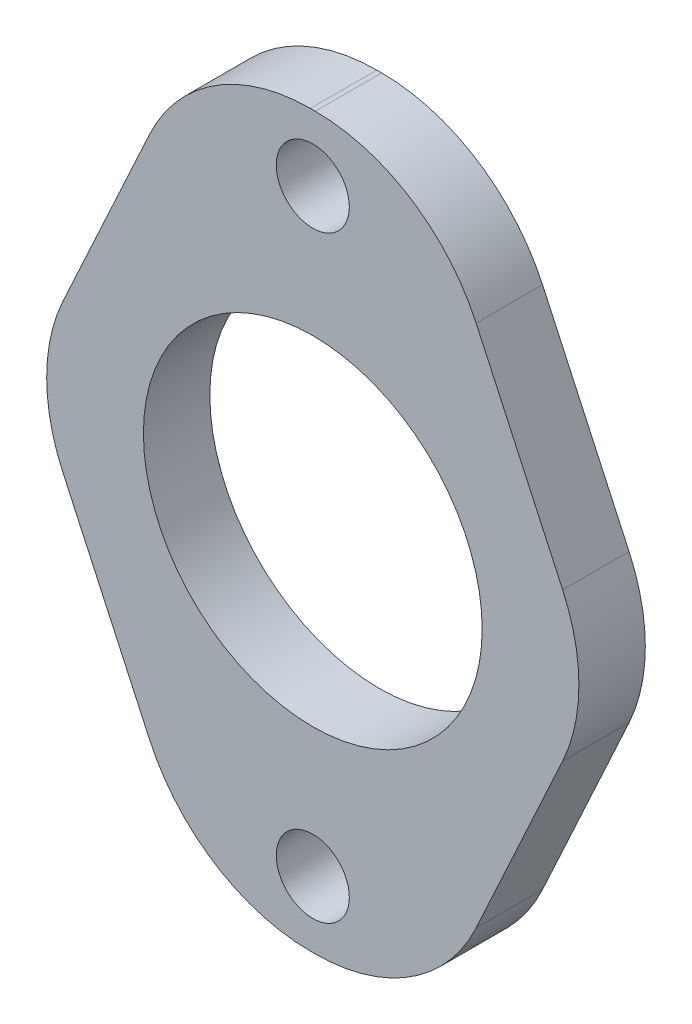
ISO-10303-21;
HEADER;
FILE_DESCRIPTION(('STEP AP214'),'2;1');
FILE_NAME('part.step','',(''),(''),'','','');
FILE_SCHEMA(('AUTOMOTIVE_DESIGN { 1 0 10303 214 1 1 1 1 }'));
ENDSEC;
DATA;
#1=APPLICATION_CONTEXT('core data for automotive mechanical design processes');
#2=APPLICATION_PROTOCOL_DEFINITION('international standard','automotive_design',2000,#1);
#3=PRODUCT_CONTEXT('',#1,'mechanical');
#4=PRODUCT('Part','Part','',(#3));
#5=PRODUCT_RELATED_PRODUCT_CATEGORY('part','',(#4));
#6=PRODUCT_DEFINITION_FORMATION('','',#4);
#7=PRODUCT_DEFINITION_CONTEXT('part definition',#1,'design');
#8=PRODUCT_DEFINITION('design','',#6,#7);
#9=PRODUCT_DEFINITION_SHAPE('','',#8);
#10=(LENGTH_UNIT() NAMED_UNIT(*) SI_UNIT(.MILLI.,.METRE.));
#11=(NAMED_UNIT(*) PLANE_ANGLE_UNIT() SI_UNIT($,.RADIAN.));
#12=(NAMED_UNIT(*) SI_UNIT($,.STERADIAN.) SOLID_ANGLE_UNIT());
#13=UNCERTAINTY_MEASURE_WITH_UNIT(LENGTH_MEASURE(1.E-05),#10,'distance_accuracy_value','');
#14=(GEOMETRIC_REPRESENTATION_CONTEXT(3) GLOBAL_UNCERTAINTY_ASSIGNED_CONTEXT((#13)) GLOBAL_UNIT_ASSIGNED_CONTEXT((#10,
#11,#12)) REPRESENTATION_CONTEXT('',''));
#15=CARTESIAN_POINT('',(0.,0.,0.));
#16=DIRECTION('',(0.,0.,1.));
#17=DIRECTION('',(1.,0.,0.));
#18=AXIS2_PLACEMENT_3D('',#15,#16,#17);
#19=CARTESIAN_POINT('',(0.,0.,3.));
#20=DIRECTION('',(0.,0.,1.));
#21=DIRECTION('',(1.,0.,0.));
#22=AXIS2_PLACEMENT_3D('',#19,#20,#21);
#23=PLANE('',#22);
#24=CARTESIAN_POINT('',(0.,-13.5,3.));
#25=DIRECTION('',(0.,0.,1.));
#26=DIRECTION('',(1.,0.,0.));
#27=AXIS2_PLACEMENT_3D('',#24,#25,#26);
#28=CIRCLE('',#27,1.65);
#29=CARTESIAN_POINT('',(1.65,-13.5,3.));
#30=VERTEX_POINT('',#29);
#31=EDGE_CURVE('E375',#30,#30,#28,.T.);
#32=ORIENTED_EDGE('',*,*,#31,.F.);
#33=EDGE_LOOP('',(#32));
#34=FACE_BOUND('',#33,.T.);
#35=DIRECTION('',(0.418518518518519,0.908208263371934,0.));
#36=VECTOR('',#35,1.);
#37=CARTESIAN_POINT('',(12.8274543073927,0.,3.));
#38=LINE('',#37,#36);
#39=CARTESIAN_POINT('',(7.37683329960607,-11.8281481481482,3.));
#40=VERTEX_POINT('',#39);
#41=CARTESIAN_POINT('',(11.2845681002788,-3.34814814814815,3.));
#42=VERTEX_POINT('',#41);
#43=EDGE_CURVE('E167',#40,#42,#38,.T.);
#44=ORIENTED_EDGE('',*,*,#43,.T.);
#45=CARTESIAN_POINT('',(4.01890199330331,0.,3.));
#46=DIRECTION('',(0.,0.,1.));
#47=DIRECTION('',(1.,0.,0.));
#48=AXIS2_PLACEMENT_3D('',#45,#46,#47);
#49=CIRCLE('',#48,8.);
#50=CARTESIAN_POINT('',(11.2845681002788,3.34814814814815,3.));
#51=VERTEX_POINT('',#50);
#52=EDGE_CURVE('E190',#42,#51,#49,.T.);
#53=ORIENTED_EDGE('',*,*,#52,.T.);
#54=DIRECTION('',(-0.418518518518519,0.908208263371934,0.));
#55=VECTOR('',#54,1.);
#56=CARTESIAN_POINT('',(12.8274543073927,0.,3.));
#57=LINE('',#56,#55);
#58=CARTESIAN_POINT('',(7.37683329960606,11.8281481481482,3.));
#59=VERTEX_POINT('',#58);
#60=EDGE_CURVE('E143',#51,#59,#57,.T.);
#61=ORIENTED_EDGE('',*,*,#60,.T.);
#62=CARTESIAN_POINT('',(0.111167192630593,8.48,3.));
#63=DIRECTION('',(0.,0.,1.));
#64=DIRECTION('',(1.,0.,0.));
#65=AXIS2_PLACEMENT_3D('',#62,#63,#64);
#66=CIRCLE('',#65,8.);
#67=CARTESIAN_POINT('',(0.111167192630593,16.48,3.));
#68=VERTEX_POINT('',#67);
#69=EDGE_CURVE('E181',#59,#68,#66,.T.);
#70=ORIENTED_EDGE('',*,*,#69,.T.);
#71=DIRECTION('',(-1.,0.,0.));
#72=VECTOR('',#71,1.);
#73=CARTESIAN_POINT('',(-5.23317724193445,16.48,3.));
#74=LINE('',#73,#72);
#75=CARTESIAN_POINT('',(-0.111167192630594,16.48,3.));
#76=VERTEX_POINT('',#75);
#77=EDGE_CURVE('E212',#68,#76,#74,.T.);
#78=ORIENTED_EDGE('',*,*,#77,.T.);
#79=CARTESIAN_POINT('',(-0.111167192630594,8.48,3.));
#80=DIRECTION('',(0.,0.,1.));
#81=DIRECTION('',(1.,0.,0.));
#82=AXIS2_PLACEMENT_3D('',#79,#80,#81);
#83=CIRCLE('',#82,8.);
#84=CARTESIAN_POINT('',(-7.37683329960607,11.8281481481482,3.));
#85=VERTEX_POINT('',#84);
#86=EDGE_CURVE('E183',#76,#85,#83,.T.);
#87=ORIENTED_EDGE('',*,*,#86,.T.);
#88=DIRECTION('',(-0.418518518518519,-0.908208263371934,0.));
#89=VECTOR('',#88,1.);
#90=CARTESIAN_POINT('',(-12.8274543073927,0.,3.));
#91=LINE('',#90,#89);
#92=CARTESIAN_POINT('',(-11.2845681002788,3.34814814814815,3.));
#93=VERTEX_POINT('',#92);
#94=EDGE_CURVE('E225',#85,#93,#91,.T.);
#95=ORIENTED_EDGE('',*,*,#94,.T.);
#96=CARTESIAN_POINT('',(-4.01890199330331,0.,3.));
#97=DIRECTION('',(0.,0.,1.));
#98=DIRECTION('',(1.,0.,0.));
#99=AXIS2_PLACEMENT_3D('',#96,#97,#98);
#100=CIRCLE('',#99,8.);
#101=CARTESIAN_POINT('',(-11.2845681002788,-3.34814814814815,3.));
#102=VERTEX_POINT('',#101);
#103=EDGE_CURVE('E188',#93,#102,#100,.T.);
#104=ORIENTED_EDGE('',*,*,#103,.T.);
#105=DIRECTION('',(0.418518518518519,-0.908208263371934,0.));
#106=VECTOR('',#105,1.);
#107=CARTESIAN_POINT('',(-12.8274543073927,0.,3.));
#108=LINE('',#107,#106);
#109=CARTESIAN_POINT('',(-7.37683329960607,-11.8281481481482,3.));
#110=VERTEX_POINT('',#109);
#111=EDGE_CURVE('E227',#102,#110,#108,.T.);
#112=ORIENTED_EDGE('',*,*,#111,.T.);
#113=CARTESIAN_POINT('',(-0.111167192630594,-8.48,3.));
#114=DIRECTION('',(0.,0.,1.));
#115=DIRECTION('',(1.,0.,0.));
#116=AXIS2_PLACEMENT_3D('',#113,#114,#115);
#117=CIRCLE('',#116,8.);
#118=CARTESIAN_POINT('',(-0.111167192630594,-16.48,3.));
#119=VERTEX_POINT('',#118);
#120=EDGE_CURVE('E55',#110,#119,#117,.T.);
#121=ORIENTED_EDGE('',*,*,#120,.T.);
#122=DIRECTION('',(1.,0.,0.));
#123=VECTOR('',#122,1.);
#124=CARTESIAN_POINT('',(-5.23317724193445,-16.48,3.));
#125=LINE('',#124,#123);
#126=CARTESIAN_POINT('',(0.111167192630594,-16.48,3.));
#127=VERTEX_POINT('',#126);
#128=EDGE_CURVE('E168',#119,#127,#125,.T.);
#129=ORIENTED_EDGE('',*,*,#128,.T.);
#130=CARTESIAN_POINT('',(0.111167192630594,-8.48,3.));
#131=DIRECTION('',(0.,0.,1.));
#132=DIRECTION('',(1.,0.,0.));
#133=AXIS2_PLACEMENT_3D('',#130,#131,#132);
#134=CIRCLE('',#133,8.);
#135=EDGE_CURVE('E186',#127,#40,#134,.T.);
#136=ORIENTED_EDGE('',*,*,#135,.T.);
#137=EDGE_LOOP('',(#44,#53,#61,#70,#78,#87,#95,#104,#112,#121,#129,#136));
#138=FACE_BOUND('',#137,.T.);
#139=CARTESIAN_POINT('',(0.,0.,3.));
#140=DIRECTION('',(0.,0.,1.));
#141=DIRECTION('',(1.,0.,0.));
#142=AXIS2_PLACEMENT_3D('',#139,#140,#141);
#143=CIRCLE('',#142,7.65);
#144=CARTESIAN_POINT('',(7.65,0.,3.));
#145=VERTEX_POINT('',#144);
#146=EDGE_CURVE('E156',#145,#145,#143,.T.);
#147=ORIENTED_EDGE('',*,*,#146,.F.);
#148=EDGE_LOOP('',(#147));
#149=FACE_BOUND('',#148,.T.);
#150=CARTESIAN_POINT('',(0.,13.5,3.));
#151=DIRECTION('',(0.,0.,1.));
#152=DIRECTION('',(1.,0.,0.));
#153=AXIS2_PLACEMENT_3D('',#150,#151,#152);
#154=CIRCLE('',#153,1.65);
#155=CARTESIAN_POINT('',(1.65,13.5,3.));
#156=VERTEX_POINT('',#155);
#157=EDGE_CURVE('E381',#156,#156,#154,.T.);
#158=ORIENTED_EDGE('',*,*,#157,.F.);
#159=EDGE_LOOP('',(#158));
#160=FACE_BOUND('',#159,.T.);
#161=ADVANCED_FACE('F33',(#34,#138,#149,#160),#23,.T.);
#162=CARTESIAN_POINT('',(0.,0.,0.));
#163=DIRECTION('',(0.,0.,1.));
#164=DIRECTION('',(1.,0.,0.));
#165=AXIS2_PLACEMENT_3D('',#162,#163,#164);
#166=PLANE('',#165);
#167=DIRECTION('',(-0.418518518518519,0.908208263371934,0.));
#168=VECTOR('',#167,1.);
#169=CARTESIAN_POINT('',(12.8274543073927,0.,0.));
#170=LINE('',#169,#168);
#171=CARTESIAN_POINT('',(11.2845681002788,3.34814814814815,0.));
#172=VERTEX_POINT('',#171);
#173=CARTESIAN_POINT('',(7.37683329960606,11.8281481481482,0.));
#174=VERTEX_POINT('',#173);
#175=EDGE_CURVE('E140',#172,#174,#170,.T.);
#176=ORIENTED_EDGE('',*,*,#175,.F.);
#177=CARTESIAN_POINT('',(4.01890199330331,0.,0.));
#178=DIRECTION('',(0.,0.,1.));
#179=DIRECTION('',(1.,0.,0.));
#180=AXIS2_PLACEMENT_3D('',#177,#178,#179);
#181=CIRCLE('',#180,8.);
#182=CARTESIAN_POINT('',(11.2845681002788,-3.34814814814815,0.));
#183=VERTEX_POINT('',#182);
#184=EDGE_CURVE('E123',#172,#183,#181,.F.);
#185=ORIENTED_EDGE('',*,*,#184,.T.);
#186=DIRECTION('',(0.418518518518519,0.908208263371934,0.));
#187=VECTOR('',#186,1.);
#188=CARTESIAN_POINT('',(12.8274543073927,0.,0.));
#189=LINE('',#188,#187);
#190=CARTESIAN_POINT('',(7.37683329960607,-11.8281481481482,0.));
#191=VERTEX_POINT('',#190);
#192=EDGE_CURVE('E151',#191,#183,#189,.T.);
#193=ORIENTED_EDGE('',*,*,#192,.F.);
#194=CARTESIAN_POINT('',(0.111167192630594,-8.48,0.));
#195=DIRECTION('',(0.,0.,1.));
#196=DIRECTION('',(1.,0.,0.));
#197=AXIS2_PLACEMENT_3D('',#194,#195,#196);
#198=CIRCLE('',#197,8.);
#199=CARTESIAN_POINT('',(0.111167192630594,-16.48,0.));
#200=VERTEX_POINT('',#199);
#201=EDGE_CURVE('E175',#191,#200,#198,.F.);
#202=ORIENTED_EDGE('',*,*,#201,.T.);
#203=DIRECTION('',(1.,0.,0.));
#204=VECTOR('',#203,1.);
#205=CARTESIAN_POINT('',(-5.23317724193445,-16.48,0.));
#206=LINE('',#205,#204);
#207=CARTESIAN_POINT('',(-0.111167192630594,-16.48,0.));
#208=VERTEX_POINT('',#207);
#209=EDGE_CURVE('E165',#208,#200,#206,.T.);
#210=ORIENTED_EDGE('',*,*,#209,.F.);
#211=CARTESIAN_POINT('',(-0.111167192630594,-8.48,0.));
#212=DIRECTION('',(0.,0.,1.));
#213=DIRECTION('',(1.,0.,0.));
#214=AXIS2_PLACEMENT_3D('',#211,#212,#213);
#215=CIRCLE('',#214,8.);
#216=CARTESIAN_POINT('',(-7.37683329960607,-11.8281481481482,0.));
#217=VERTEX_POINT('',#216);
#218=EDGE_CURVE('E173',#208,#217,#215,.F.);
#219=ORIENTED_EDGE('',*,*,#218,.T.);
#220=DIRECTION('',(0.418518518518519,-0.908208263371934,0.));
#221=VECTOR('',#220,1.);
#222=CARTESIAN_POINT('',(-12.8274543073927,0.,0.));
#223=LINE('',#222,#221);
#224=CARTESIAN_POINT('',(-11.2845681002788,-3.34814814814815,0.));
#225=VERTEX_POINT('',#224);
#226=EDGE_CURVE('E162',#225,#217,#223,.T.);
#227=ORIENTED_EDGE('',*,*,#226,.F.);
#228=CARTESIAN_POINT('',(-4.01890199330331,0.,0.));
#229=DIRECTION('',(0.,0.,1.));
#230=DIRECTION('',(1.,0.,0.));
#231=AXIS2_PLACEMENT_3D('',#228,#229,#230);
#232=CIRCLE('',#231,8.);
#233=CARTESIAN_POINT('',(-11.2845681002788,3.34814814814815,0.));
#234=VERTEX_POINT('',#233);
#235=EDGE_CURVE('E134',#225,#234,#232,.F.);
#236=ORIENTED_EDGE('',*,*,#235,.T.);
#237=DIRECTION('',(-0.418518518518519,-0.908208263371934,0.));
#238=VECTOR('',#237,1.);
#239=CARTESIAN_POINT('',(-12.8274543073927,0.,0.));
#240=LINE('',#239,#238);
#241=CARTESIAN_POINT('',(-7.37683329960607,11.8281481481482,0.));
#242=VERTEX_POINT('',#241);
#243=EDGE_CURVE('E154',#242,#234,#240,.T.);
#244=ORIENTED_EDGE('',*,*,#243,.F.);
#245=CARTESIAN_POINT('',(-0.111167192630594,8.48,0.));
#246=DIRECTION('',(0.,0.,1.));
#247=DIRECTION('',(1.,0.,0.));
#248=AXIS2_PLACEMENT_3D('',#245,#246,#247);
#249=CIRCLE('',#248,8.);
#250=CARTESIAN_POINT('',(-0.111167192630594,16.48,0.));
#251=VERTEX_POINT('',#250);
#252=EDGE_CURVE('E171',#242,#251,#249,.F.);
#253=ORIENTED_EDGE('',*,*,#252,.T.);
#254=DIRECTION('',(-1.,0.,0.));
#255=VECTOR('',#254,1.);
#256=CARTESIAN_POINT('',(-5.23317724193445,16.48,0.));
#257=LINE('',#256,#255);
#258=CARTESIAN_POINT('',(0.111167192630593,16.48,0.));
#259=VERTEX_POINT('',#258);
#260=EDGE_CURVE('E150',#259,#251,#257,.T.);
#261=ORIENTED_EDGE('',*,*,#260,.F.);
#262=CARTESIAN_POINT('',(0.111167192630593,8.48,0.));
#263=DIRECTION('',(0.,0.,1.));
#264=DIRECTION('',(1.,0.,0.));
#265=AXIS2_PLACEMENT_3D('',#262,#263,#264);
#266=CIRCLE('',#265,8.);
#267=EDGE_CURVE('E144',#259,#174,#266,.F.);
#268=ORIENTED_EDGE('',*,*,#267,.T.);
#269=EDGE_LOOP('',(#176,#185,#193,#202,#210,#219,#227,#236,#244,#253,#261,#268));
#270=FACE_BOUND('',#269,.T.);
#271=CARTESIAN_POINT('',(0.,0.,0.));
#272=DIRECTION('',(0.,0.,1.));
#273=DIRECTION('',(1.,0.,0.));
#274=AXIS2_PLACEMENT_3D('',#271,#272,#273);
#275=CIRCLE('',#274,7.65);
#276=CARTESIAN_POINT('',(7.65,0.,0.));
#277=VERTEX_POINT('',#276);
#278=EDGE_CURVE('E372',#277,#277,#275,.T.);
#279=ORIENTED_EDGE('',*,*,#278,.T.);
#280=EDGE_LOOP('',(#279));
#281=FACE_BOUND('',#280,.T.);
#282=CARTESIAN_POINT('',(0.,-13.5,0.));
#283=DIRECTION('',(0.,0.,1.));
#284=DIRECTION('',(1.,0.,0.));
#285=AXIS2_PLACEMENT_3D('',#282,#283,#284);
#286=CIRCLE('',#285,1.65);
#287=CARTESIAN_POINT('',(1.65,-13.5,0.));
#288=VERTEX_POINT('',#287);
#289=EDGE_CURVE('E378',#288,#288,#286,.T.);
#290=ORIENTED_EDGE('',*,*,#289,.T.);
#291=EDGE_LOOP('',(#290));
#292=FACE_BOUND('',#291,.T.);
#293=CARTESIAN_POINT('',(0.,13.5,0.));
#294=DIRECTION('',(0.,0.,1.));
#295=DIRECTION('',(1.,0.,0.));
#296=AXIS2_PLACEMENT_3D('',#293,#294,#295);
#297=CIRCLE('',#296,1.65);
#298=CARTESIAN_POINT('',(1.65,13.5,0.));
#299=VERTEX_POINT('',#298);
#300=EDGE_CURVE('E384',#299,#299,#297,.T.);
#301=ORIENTED_EDGE('',*,*,#300,.T.);
#302=EDGE_LOOP('',(#301));
#303=FACE_BOUND('',#302,.T.);
#304=ADVANCED_FACE('F147',(#270,#281,#292,#303),#166,.F.);
#305=CARTESIAN_POINT('',(12.8274543073927,0.,3.));
#306=DIRECTION('',(-0.908208263371934,0.418518518518519,0.));
#307=DIRECTION('',(-0.418518518518519,-0.908208263371934,0.));
#308=AXIS2_PLACEMENT_3D('',#305,#306,#307);
#309=PLANE('',#308);
#310=ORIENTED_EDGE('',*,*,#192,.T.);
#311=DIRECTION('',(0.,0.,-1.));
#312=VECTOR('',#311,1.);
#313=CARTESIAN_POINT('',(11.2845681002788,-3.34814814814815,3.));
#314=LINE('',#313,#312);
#315=EDGE_CURVE('E128',#183,#42,#314,.F.);
#316=ORIENTED_EDGE('',*,*,#315,.T.);
#317=ORIENTED_EDGE('',*,*,#43,.F.);
#318=DIRECTION('',(0.,0.,-1.));
#319=VECTOR('',#318,1.);
#320=CARTESIAN_POINT('',(7.37683329960607,-11.8281481481482,3.));
#321=LINE('',#320,#319);
#322=EDGE_CURVE('E133',#40,#191,#321,.T.);
#323=ORIENTED_EDGE('',*,*,#322,.T.);
#324=EDGE_LOOP('',(#310,#316,#317,#323));
#325=FACE_BOUND('',#324,.T.);
#326=ADVANCED_FACE('F241',(#325),#309,.F.);
#327=CARTESIAN_POINT('',(12.8274543073927,0.,3.));
#328=DIRECTION('',(-0.908208263371934,-0.418518518518519,0.));
#329=DIRECTION('',(0.418518518518519,-0.908208263371934,0.));
#330=AXIS2_PLACEMENT_3D('',#327,#328,#329);
#331=PLANE('',#330);
#332=ORIENTED_EDGE('',*,*,#60,.F.);
#333=DIRECTION('',(0.,0.,-1.));
#334=VECTOR('',#333,1.);
#335=CARTESIAN_POINT('',(11.2845681002788,3.34814814814815,3.));
#336=LINE('',#335,#334);
#337=EDGE_CURVE('E127',#51,#172,#336,.T.);
#338=ORIENTED_EDGE('',*,*,#337,.T.);
#339=ORIENTED_EDGE('',*,*,#175,.T.);
#340=DIRECTION('',(0.,0.,-1.));
#341=VECTOR('',#340,1.);
#342=CARTESIAN_POINT('',(7.37683329960606,11.8281481481482,3.));
#343=LINE('',#342,#341);
#344=EDGE_CURVE('E145',#174,#59,#343,.F.);
#345=ORIENTED_EDGE('',*,*,#344,.T.);
#346=EDGE_LOOP('',(#332,#338,#339,#345));
#347=FACE_BOUND('',#346,.T.);
#348=ADVANCED_FACE('F139',(#347),#331,.F.);
#349=CARTESIAN_POINT('',(-5.23317724193445,16.48,3.));
#350=DIRECTION('',(0.,-1.,0.));
#351=DIRECTION('',(0.,0.,-1.));
#352=AXIS2_PLACEMENT_3D('',#349,#350,#351);
#353=PLANE('',#352);
#354=ORIENTED_EDGE('',*,*,#260,.T.);
#355=DIRECTION('',(0.,0.,-1.));
#356=VECTOR('',#355,1.);
#357=CARTESIAN_POINT('',(-0.111167192630594,16.48,3.));
#358=LINE('',#357,#356);
#359=EDGE_CURVE('E11',#251,#76,#358,.F.);
#360=ORIENTED_EDGE('',*,*,#359,.T.);
#361=ORIENTED_EDGE('',*,*,#77,.F.);
#362=DIRECTION('',(0.,0.,-1.));
#363=VECTOR('',#362,1.);
#364=CARTESIAN_POINT('',(0.111167192630593,16.48,3.));
#365=LINE('',#364,#363);
#366=EDGE_CURVE('E41',#68,#259,#365,.T.);
#367=ORIENTED_EDGE('',*,*,#366,.T.);
#368=EDGE_LOOP('',(#354,#360,#361,#367));
#369=FACE_BOUND('',#368,.T.);
#370=ADVANCED_FACE('F209',(#369),#353,.F.);
#371=CARTESIAN_POINT('',(-12.8274543073927,0.,3.));
#372=DIRECTION('',(0.908208263371934,-0.418518518518519,0.));
#373=DIRECTION('',(0.418518518518519,0.908208263371934,0.));
#374=AXIS2_PLACEMENT_3D('',#371,#372,#373);
#375=PLANE('',#374);
#376=ORIENTED_EDGE('',*,*,#243,.T.);
#377=DIRECTION('',(0.,0.,-1.));
#378=VECTOR('',#377,1.);
#379=CARTESIAN_POINT('',(-11.2845681002788,3.34814814814815,3.));
#380=LINE('',#379,#378);
#381=EDGE_CURVE('E200',#234,#93,#380,.F.);
#382=ORIENTED_EDGE('',*,*,#381,.T.);
#383=ORIENTED_EDGE('',*,*,#94,.F.);
#384=DIRECTION('',(0.,0.,-1.));
#385=VECTOR('',#384,1.);
#386=CARTESIAN_POINT('',(-7.37683329960607,11.8281481481482,3.));
#387=LINE('',#386,#385);
#388=EDGE_CURVE('E197',#85,#242,#387,.T.);
#389=ORIENTED_EDGE('',*,*,#388,.T.);
#390=EDGE_LOOP('',(#376,#382,#383,#389));
#391=FACE_BOUND('',#390,.T.);
#392=ADVANCED_FACE('F222',(#391),#375,.F.);
#393=CARTESIAN_POINT('',(-12.8274543073927,0.,3.));
#394=DIRECTION('',(0.908208263371934,0.418518518518519,0.));
#395=DIRECTION('',(-0.418518518518519,0.908208263371934,0.));
#396=AXIS2_PLACEMENT_3D('',#393,#394,#395);
#397=PLANE('',#396);
#398=ORIENTED_EDGE('',*,*,#111,.F.);
#399=DIRECTION('',(0.,0.,-1.));
#400=VECTOR('',#399,1.);
#401=CARTESIAN_POINT('',(-11.2845681002788,-3.34814814814815,3.));
#402=LINE('',#401,#400);
#403=EDGE_CURVE('E194',#102,#225,#402,.T.);
#404=ORIENTED_EDGE('',*,*,#403,.T.);
#405=ORIENTED_EDGE('',*,*,#226,.T.);
#406=DIRECTION('',(0.,0.,-1.));
#407=VECTOR('',#406,1.);
#408=CARTESIAN_POINT('',(-7.37683329960607,-11.8281481481482,3.));
#409=LINE('',#408,#407);
#410=EDGE_CURVE('E192',#217,#110,#409,.F.);
#411=ORIENTED_EDGE('',*,*,#410,.T.);
#412=EDGE_LOOP('',(#398,#404,#405,#411));
#413=FACE_BOUND('',#412,.T.);
#414=ADVANCED_FACE('F250',(#413),#397,.F.);
#415=CARTESIAN_POINT('',(-5.23317724193445,-16.48,3.));
#416=DIRECTION('',(0.,1.,0.));
#417=DIRECTION('',(0.,0.,1.));
#418=AXIS2_PLACEMENT_3D('',#415,#416,#417);
#419=PLANE('',#418);
#420=ORIENTED_EDGE('',*,*,#209,.T.);
#421=DIRECTION('',(0.,0.,-1.));
#422=VECTOR('',#421,1.);
#423=CARTESIAN_POINT('',(0.111167192630594,-16.48,3.));
#424=LINE('',#423,#422);
#425=EDGE_CURVE('E48',#200,#127,#424,.F.);
#426=ORIENTED_EDGE('',*,*,#425,.T.);
#427=ORIENTED_EDGE('',*,*,#128,.F.);
#428=DIRECTION('',(0.,0.,-1.));
#429=VECTOR('',#428,1.);
#430=CARTESIAN_POINT('',(-0.111167192630594,-16.48,3.));
#431=LINE('',#430,#429);
#432=EDGE_CURVE('E202',#119,#208,#431,.T.);
#433=ORIENTED_EDGE('',*,*,#432,.T.);
#434=EDGE_LOOP('',(#420,#426,#427,#433));
#435=FACE_BOUND('',#434,.T.);
#436=ADVANCED_FACE('F243',(#435),#419,.F.);
#437=CARTESIAN_POINT('',(0.,0.,3.));
#438=DIRECTION('',(0.,0.,-1.));
#439=DIRECTION('',(-1.,0.,0.));
#440=AXIS2_PLACEMENT_3D('',#437,#438,#439);
#441=CYLINDRICAL_SURFACE('',#440,7.65);
#442=ORIENTED_EDGE('',*,*,#146,.T.);
#443=EDGE_LOOP('',(#442));
#444=FACE_BOUND('',#443,.T.);
#445=ORIENTED_EDGE('',*,*,#278,.F.);
#446=EDGE_LOOP('',(#445));
#447=FACE_BOUND('',#446,.T.);
#448=ADVANCED_FACE('F272',(#444,#447),#441,.F.);
#449=CARTESIAN_POINT('',(0.,-13.5,3.));
#450=DIRECTION('',(0.,0.,-1.));
#451=DIRECTION('',(-1.,0.,0.));
#452=AXIS2_PLACEMENT_3D('',#449,#450,#451);
#453=CYLINDRICAL_SURFACE('',#452,1.65);
#454=ORIENTED_EDGE('',*,*,#31,.T.);
#455=EDGE_LOOP('',(#454));
#456=FACE_BOUND('',#455,.T.);
#457=ORIENTED_EDGE('',*,*,#289,.F.);
#458=EDGE_LOOP('',(#457));
#459=FACE_BOUND('',#458,.T.);
#460=ADVANCED_FACE('F317',(#456,#459),#453,.F.);
#461=CARTESIAN_POINT('',(0.,13.5,3.));
#462=DIRECTION('',(0.,0.,-1.));
#463=DIRECTION('',(-1.,0.,0.));
#464=AXIS2_PLACEMENT_3D('',#461,#462,#463);
#465=CYLINDRICAL_SURFACE('',#464,1.65);
#466=ORIENTED_EDGE('',*,*,#157,.T.);
#467=EDGE_LOOP('',(#466));
#468=FACE_BOUND('',#467,.T.);
#469=ORIENTED_EDGE('',*,*,#300,.F.);
#470=EDGE_LOOP('',(#469));
#471=FACE_BOUND('',#470,.T.);
#472=ADVANCED_FACE('F261',(#468,#471),#465,.F.);
#473=CARTESIAN_POINT('',(4.01890199330331,0.,3.));
#474=DIRECTION('',(0.,0.,-1.));
#475=DIRECTION('',(-1.,0.,0.));
#476=AXIS2_PLACEMENT_3D('',#473,#474,#475);
#477=CYLINDRICAL_SURFACE('',#476,8.);
#478=ORIENTED_EDGE('',*,*,#52,.F.);
#479=ORIENTED_EDGE('',*,*,#315,.F.);
#480=ORIENTED_EDGE('',*,*,#184,.F.);
#481=ORIENTED_EDGE('',*,*,#337,.F.);
#482=EDGE_LOOP('',(#478,#479,#480,#481));
#483=FACE_BOUND('',#482,.T.);
#484=ADVANCED_FACE('F126',(#483),#477,.T.);
#485=CARTESIAN_POINT('',(-4.01890199330331,0.,3.));
#486=DIRECTION('',(0.,0.,-1.));
#487=DIRECTION('',(-1.,0.,0.));
#488=AXIS2_PLACEMENT_3D('',#485,#486,#487);
#489=CYLINDRICAL_SURFACE('',#488,8.);
#490=ORIENTED_EDGE('',*,*,#103,.F.);
#491=ORIENTED_EDGE('',*,*,#381,.F.);
#492=ORIENTED_EDGE('',*,*,#235,.F.);
#493=ORIENTED_EDGE('',*,*,#403,.F.);
#494=EDGE_LOOP('',(#490,#491,#492,#493));
#495=FACE_BOUND('',#494,.T.);
#496=ADVANCED_FACE('F253',(#495),#489,.T.);
#497=CARTESIAN_POINT('',(0.111167192630594,-8.48,3.));
#498=DIRECTION('',(0.,0.,-1.));
#499=DIRECTION('',(-1.,0.,0.));
#500=AXIS2_PLACEMENT_3D('',#497,#498,#499);
#501=CYLINDRICAL_SURFACE('',#500,8.);
#502=ORIENTED_EDGE('',*,*,#135,.F.);
#503=ORIENTED_EDGE('',*,*,#425,.F.);
#504=ORIENTED_EDGE('',*,*,#201,.F.);
#505=ORIENTED_EDGE('',*,*,#322,.F.);
#506=EDGE_LOOP('',(#502,#503,#504,#505));
#507=FACE_BOUND('',#506,.T.);
#508=ADVANCED_FACE('F239',(#507),#501,.T.);
#509=CARTESIAN_POINT('',(-0.111167192630594,-8.48,3.));
#510=DIRECTION('',(0.,0.,-1.));
#511=DIRECTION('',(-1.,0.,0.));
#512=AXIS2_PLACEMENT_3D('',#509,#510,#511);
#513=CYLINDRICAL_SURFACE('',#512,8.);
#514=ORIENTED_EDGE('',*,*,#120,.F.);
#515=ORIENTED_EDGE('',*,*,#410,.F.);
#516=ORIENTED_EDGE('',*,*,#218,.F.);
#517=ORIENTED_EDGE('',*,*,#432,.F.);
#518=EDGE_LOOP('',(#514,#515,#516,#517));
#519=FACE_BOUND('',#518,.T.);
#520=ADVANCED_FACE('F245',(#519),#513,.T.);
#521=CARTESIAN_POINT('',(-0.111167192630594,8.48,3.));
#522=DIRECTION('',(0.,0.,-1.));
#523=DIRECTION('',(-1.,0.,0.));
#524=AXIS2_PLACEMENT_3D('',#521,#522,#523);
#525=CYLINDRICAL_SURFACE('',#524,8.);
#526=ORIENTED_EDGE('',*,*,#86,.F.);
#527=ORIENTED_EDGE('',*,*,#359,.F.);
#528=ORIENTED_EDGE('',*,*,#252,.F.);
#529=ORIENTED_EDGE('',*,*,#388,.F.);
#530=EDGE_LOOP('',(#526,#527,#528,#529));
#531=FACE_BOUND('',#530,.T.);
#532=ADVANCED_FACE('F219',(#531),#525,.T.);
#533=CARTESIAN_POINT('',(0.111167192630593,8.48,3.));
#534=DIRECTION('',(0.,0.,-1.));
#535=DIRECTION('',(-1.,0.,0.));
#536=AXIS2_PLACEMENT_3D('',#533,#534,#535);
#537=CYLINDRICAL_SURFACE('',#536,8.);
#538=ORIENTED_EDGE('',*,*,#69,.F.);
#539=ORIENTED_EDGE('',*,*,#344,.F.);
#540=ORIENTED_EDGE('',*,*,#267,.F.);
#541=ORIENTED_EDGE('',*,*,#366,.F.);
#542=EDGE_LOOP('',(#538,#539,#540,#541));
#543=FACE_BOUND('',#542,.T.);
#544=ADVANCED_FACE('F35',(#543),#537,.T.);
#545=CLOSED_SHELL('',(#161,#304,#326,#348,#370,#392,#414,#436,#448,#460,#472,#484,#496,#508,
#520,#532,#544));
#546=MANIFOLD_SOLID_BREP('B2',#545);
#547=ADVANCED_BREP_SHAPE_REPRESENTATION('',(#18,#546),#14);
#548=SHAPE_DEFINITION_REPRESENTATION(#9,#547);
ENDSEC;
END-ISO-10303-21;
